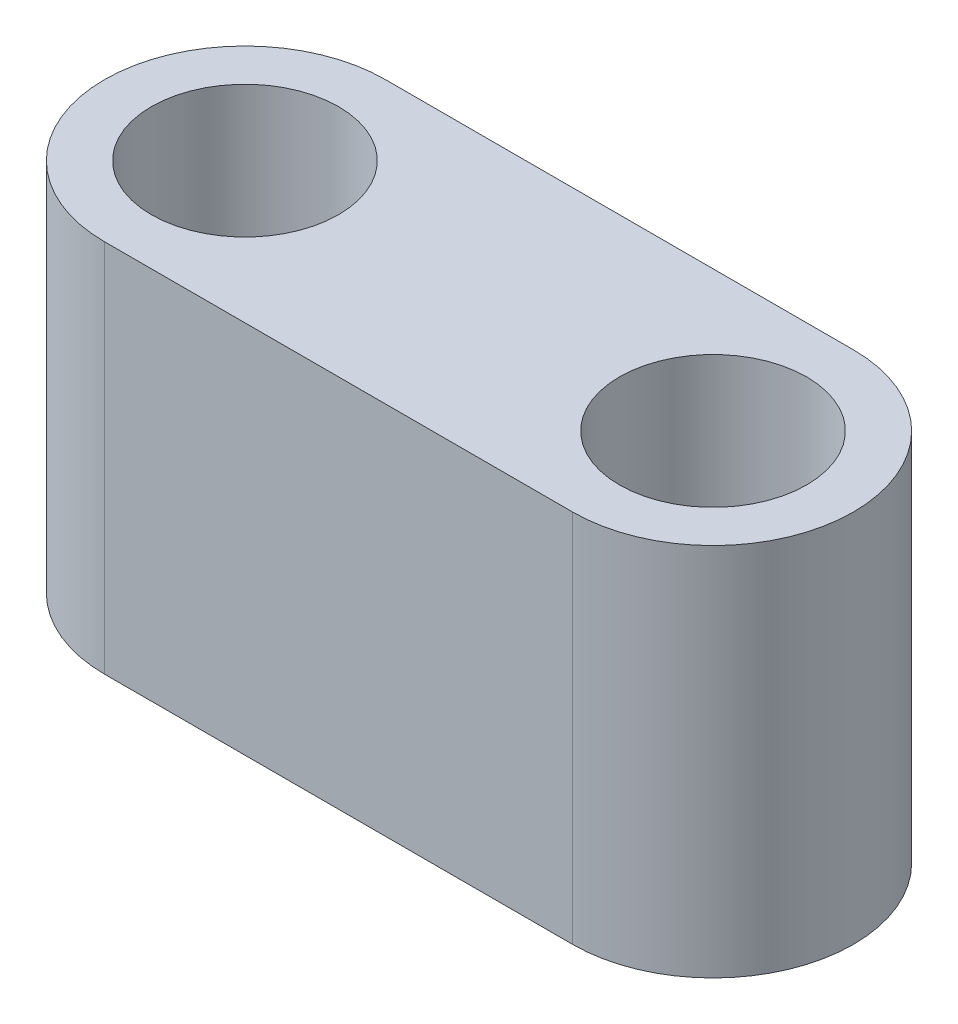
ISO-10303-21;
HEADER;
FILE_DESCRIPTION(('STEP AP214'),'2;1');
FILE_NAME('part.step','',(''),(''),'','','');
FILE_SCHEMA(('AUTOMOTIVE_DESIGN { 1 0 10303 214 1 1 1 1 }'));
ENDSEC;
DATA;
#1=APPLICATION_CONTEXT('core data for automotive mechanical design processes');
#2=APPLICATION_PROTOCOL_DEFINITION('international standard','automotive_design',2000,#1);
#3=PRODUCT_CONTEXT('',#1,'mechanical');
#4=PRODUCT('Part','Part','',(#3));
#5=PRODUCT_RELATED_PRODUCT_CATEGORY('part','',(#4));
#6=PRODUCT_DEFINITION_FORMATION('','',#4);
#7=PRODUCT_DEFINITION_CONTEXT('part definition',#1,'design');
#8=PRODUCT_DEFINITION('design','',#6,#7);
#9=PRODUCT_DEFINITION_SHAPE('','',#8);
#10=(LENGTH_UNIT() NAMED_UNIT(*) SI_UNIT(.MILLI.,.METRE.));
#11=(NAMED_UNIT(*) PLANE_ANGLE_UNIT() SI_UNIT($,.RADIAN.));
#12=(NAMED_UNIT(*) SI_UNIT($,.STERADIAN.) SOLID_ANGLE_UNIT());
#13=UNCERTAINTY_MEASURE_WITH_UNIT(LENGTH_MEASURE(1.E-05),#10,'distance_accuracy_value','');
#14=(GEOMETRIC_REPRESENTATION_CONTEXT(3) GLOBAL_UNCERTAINTY_ASSIGNED_CONTEXT((#13)) GLOBAL_UNIT_ASSIGNED_CONTEXT((#10,
#11,#12)) REPRESENTATION_CONTEXT('',''));
#15=CARTESIAN_POINT('',(0.,0.,0.));
#16=DIRECTION('',(0.,0.,1.));
#17=DIRECTION('',(1.,0.,0.));
#18=AXIS2_PLACEMENT_3D('',#15,#16,#17);
#19=CARTESIAN_POINT('',(0.,4.,0.));
#20=DIRECTION('',(0.,1.,0.));
#21=DIRECTION('',(0.,0.,1.));
#22=AXIS2_PLACEMENT_3D('',#19,#20,#21);
#23=PLANE('',#22);
#24=CARTESIAN_POINT('',(0.,4.,0.));
#25=DIRECTION('',(0.,1.,0.));
#26=DIRECTION('',(0.,0.,1.));
#27=AXIS2_PLACEMENT_3D('',#24,#25,#26);
#28=CIRCLE('',#27,1.);
#29=CARTESIAN_POINT('',(0.,4.,1.));
#30=VERTEX_POINT('',#29);
#31=EDGE_CURVE('E116',#30,#30,#28,.T.);
#32=ORIENTED_EDGE('',*,*,#31,.F.);
#33=EDGE_LOOP('',(#32));
#34=FACE_BOUND('',#33,.T.);
#35=CARTESIAN_POINT('',(0.,4.,0.));
#36=DIRECTION('',(0.,1.,0.));
#37=DIRECTION('',(0.,0.,1.));
#38=AXIS2_PLACEMENT_3D('',#35,#36,#37);
#39=CIRCLE('',#38,1.5);
#40=CARTESIAN_POINT('',(0.,4.,-1.5));
#41=VERTEX_POINT('',#40);
#42=CARTESIAN_POINT('',(0.,4.,1.5));
#43=VERTEX_POINT('',#42);
#44=EDGE_CURVE('E96',#41,#43,#39,.T.);
#45=ORIENTED_EDGE('',*,*,#44,.T.);
#46=DIRECTION('',(1.,0.,0.));
#47=VECTOR('',#46,1.);
#48=CARTESIAN_POINT('',(0.,4.,1.5));
#49=LINE('',#48,#47);
#50=CARTESIAN_POINT('',(5.,4.,1.5));
#51=VERTEX_POINT('',#50);
#52=EDGE_CURVE('E91',#43,#51,#49,.T.);
#53=ORIENTED_EDGE('',*,*,#52,.T.);
#54=CARTESIAN_POINT('',(5.,4.,0.));
#55=DIRECTION('',(0.,1.,0.));
#56=DIRECTION('',(0.,0.,1.));
#57=AXIS2_PLACEMENT_3D('',#54,#55,#56);
#58=CIRCLE('',#57,1.5);
#59=CARTESIAN_POINT('',(5.,4.,-1.5));
#60=VERTEX_POINT('',#59);
#61=EDGE_CURVE('E94',#51,#60,#58,.T.);
#62=ORIENTED_EDGE('',*,*,#61,.T.);
#63=DIRECTION('',(-1.,0.,0.));
#64=VECTOR('',#63,1.);
#65=CARTESIAN_POINT('',(0.,4.,-1.5));
#66=LINE('',#65,#64);
#67=EDGE_CURVE('E61',#60,#41,#66,.T.);
#68=ORIENTED_EDGE('',*,*,#67,.T.);
#69=EDGE_LOOP('',(#45,#53,#62,#68));
#70=FACE_BOUND('',#69,.T.);
#71=CARTESIAN_POINT('',(5.,4.,0.));
#72=DIRECTION('',(0.,1.,0.));
#73=DIRECTION('',(0.,0.,1.));
#74=AXIS2_PLACEMENT_3D('',#71,#72,#73);
#75=CIRCLE('',#74,1.);
#76=CARTESIAN_POINT('',(5.,4.,1.));
#77=VERTEX_POINT('',#76);
#78=EDGE_CURVE('E138',#77,#77,#75,.T.);
#79=ORIENTED_EDGE('',*,*,#78,.F.);
#80=EDGE_LOOP('',(#79));
#81=FACE_BOUND('',#80,.T.);
#82=ADVANCED_FACE('F43',(#34,#70,#81),#23,.T.);
#83=CARTESIAN_POINT('',(0.,0.,0.));
#84=DIRECTION('',(0.,1.,0.));
#85=DIRECTION('',(0.,0.,1.));
#86=AXIS2_PLACEMENT_3D('',#83,#84,#85);
#87=PLANE('',#86);
#88=CARTESIAN_POINT('',(0.,0.,0.));
#89=DIRECTION('',(0.,1.,0.));
#90=DIRECTION('',(0.,0.,1.));
#91=AXIS2_PLACEMENT_3D('',#88,#89,#90);
#92=CIRCLE('',#91,1.5);
#93=CARTESIAN_POINT('',(0.,0.,-1.5));
#94=VERTEX_POINT('',#93);
#95=CARTESIAN_POINT('',(0.,0.,1.5));
#96=VERTEX_POINT('',#95);
#97=EDGE_CURVE('E112',#94,#96,#92,.T.);
#98=ORIENTED_EDGE('',*,*,#97,.F.);
#99=DIRECTION('',(-1.,0.,0.));
#100=VECTOR('',#99,1.);
#101=CARTESIAN_POINT('',(0.,0.,-1.5));
#102=LINE('',#101,#100);
#103=CARTESIAN_POINT('',(5.,0.,-1.5));
#104=VERTEX_POINT('',#103);
#105=EDGE_CURVE('E84',#104,#94,#102,.T.);
#106=ORIENTED_EDGE('',*,*,#105,.F.);
#107=CARTESIAN_POINT('',(5.,0.,0.));
#108=DIRECTION('',(0.,1.,0.));
#109=DIRECTION('',(0.,0.,1.));
#110=AXIS2_PLACEMENT_3D('',#107,#108,#109);
#111=CIRCLE('',#110,1.5);
#112=CARTESIAN_POINT('',(5.,0.,1.5));
#113=VERTEX_POINT('',#112);
#114=EDGE_CURVE('E78',#113,#104,#111,.T.);
#115=ORIENTED_EDGE('',*,*,#114,.F.);
#116=DIRECTION('',(1.,0.,0.));
#117=VECTOR('',#116,1.);
#118=CARTESIAN_POINT('',(0.,0.,1.5));
#119=LINE('',#118,#117);
#120=EDGE_CURVE('E101',#96,#113,#119,.T.);
#121=ORIENTED_EDGE('',*,*,#120,.F.);
#122=EDGE_LOOP('',(#98,#106,#115,#121));
#123=FACE_BOUND('',#122,.T.);
#124=CARTESIAN_POINT('',(0.,0.,0.));
#125=DIRECTION('',(0.,1.,0.));
#126=DIRECTION('',(0.,0.,1.));
#127=AXIS2_PLACEMENT_3D('',#124,#125,#126);
#128=CIRCLE('',#127,1.);
#129=CARTESIAN_POINT('',(0.,0.,1.));
#130=VERTEX_POINT('',#129);
#131=EDGE_CURVE('E134',#130,#130,#128,.T.);
#132=ORIENTED_EDGE('',*,*,#131,.T.);
#133=EDGE_LOOP('',(#132));
#134=FACE_BOUND('',#133,.T.);
#135=CARTESIAN_POINT('',(5.,0.,0.));
#136=DIRECTION('',(0.,1.,0.));
#137=DIRECTION('',(0.,0.,1.));
#138=AXIS2_PLACEMENT_3D('',#135,#136,#137);
#139=CIRCLE('',#138,1.);
#140=CARTESIAN_POINT('',(5.,0.,1.));
#141=VERTEX_POINT('',#140);
#142=EDGE_CURVE('E142',#141,#141,#139,.T.);
#143=ORIENTED_EDGE('',*,*,#142,.T.);
#144=EDGE_LOOP('',(#143));
#145=FACE_BOUND('',#144,.T.);
#146=ADVANCED_FACE('F129',(#123,#134,#145),#87,.F.);
#147=CARTESIAN_POINT('',(0.,4.,0.));
#148=DIRECTION('',(0.,-1.,0.));
#149=DIRECTION('',(0.,0.,-1.));
#150=AXIS2_PLACEMENT_3D('',#147,#148,#149);
#151=CYLINDRICAL_SURFACE('',#150,1.5);
#152=ORIENTED_EDGE('',*,*,#97,.T.);
#153=DIRECTION('',(0.,-1.,0.));
#154=VECTOR('',#153,1.);
#155=CARTESIAN_POINT('',(0.,4.,1.5));
#156=LINE('',#155,#154);
#157=EDGE_CURVE('E11',#43,#96,#156,.T.);
#158=ORIENTED_EDGE('',*,*,#157,.F.);
#159=ORIENTED_EDGE('',*,*,#44,.F.);
#160=DIRECTION('',(0.,-1.,0.));
#161=VECTOR('',#160,1.);
#162=CARTESIAN_POINT('',(0.,4.,-1.5));
#163=LINE('',#162,#161);
#164=EDGE_CURVE('E108',#41,#94,#163,.T.);
#165=ORIENTED_EDGE('',*,*,#164,.T.);
#166=EDGE_LOOP('',(#152,#158,#159,#165));
#167=FACE_BOUND('',#166,.T.);
#168=ADVANCED_FACE('F45',(#167),#151,.T.);
#169=CARTESIAN_POINT('',(0.,4.,1.5));
#170=DIRECTION('',(0.,0.,-1.));
#171=DIRECTION('',(-1.,0.,0.));
#172=AXIS2_PLACEMENT_3D('',#169,#170,#171);
#173=PLANE('',#172);
#174=ORIENTED_EDGE('',*,*,#120,.T.);
#175=DIRECTION('',(0.,-1.,0.));
#176=VECTOR('',#175,1.);
#177=CARTESIAN_POINT('',(5.,4.,1.5));
#178=LINE('',#177,#176);
#179=EDGE_CURVE('E53',#51,#113,#178,.T.);
#180=ORIENTED_EDGE('',*,*,#179,.F.);
#181=ORIENTED_EDGE('',*,*,#52,.F.);
#182=ORIENTED_EDGE('',*,*,#157,.T.);
#183=EDGE_LOOP('',(#174,#180,#181,#182));
#184=FACE_BOUND('',#183,.T.);
#185=ADVANCED_FACE('F100',(#184),#173,.F.);
#186=CARTESIAN_POINT('',(5.,4.,0.));
#187=DIRECTION('',(0.,-1.,0.));
#188=DIRECTION('',(0.,0.,-1.));
#189=AXIS2_PLACEMENT_3D('',#186,#187,#188);
#190=CYLINDRICAL_SURFACE('',#189,1.5);
#191=ORIENTED_EDGE('',*,*,#114,.T.);
#192=DIRECTION('',(0.,-1.,0.));
#193=VECTOR('',#192,1.);
#194=CARTESIAN_POINT('',(5.,4.,-1.5));
#195=LINE('',#194,#193);
#196=EDGE_CURVE('E103',#60,#104,#195,.T.);
#197=ORIENTED_EDGE('',*,*,#196,.F.);
#198=ORIENTED_EDGE('',*,*,#61,.F.);
#199=ORIENTED_EDGE('',*,*,#179,.T.);
#200=EDGE_LOOP('',(#191,#197,#198,#199));
#201=FACE_BOUND('',#200,.T.);
#202=ADVANCED_FACE('F104',(#201),#190,.T.);
#203=CARTESIAN_POINT('',(0.,4.,-1.5));
#204=DIRECTION('',(0.,0.,1.));
#205=DIRECTION('',(1.,0.,0.));
#206=AXIS2_PLACEMENT_3D('',#203,#204,#205);
#207=PLANE('',#206);
#208=ORIENTED_EDGE('',*,*,#105,.T.);
#209=ORIENTED_EDGE('',*,*,#164,.F.);
#210=ORIENTED_EDGE('',*,*,#67,.F.);
#211=ORIENTED_EDGE('',*,*,#196,.T.);
#212=EDGE_LOOP('',(#208,#209,#210,#211));
#213=FACE_BOUND('',#212,.T.);
#214=ADVANCED_FACE('F126',(#213),#207,.F.);
#215=CARTESIAN_POINT('',(0.,4.,0.));
#216=DIRECTION('',(0.,-1.,0.));
#217=DIRECTION('',(0.,0.,-1.));
#218=AXIS2_PLACEMENT_3D('',#215,#216,#217);
#219=CYLINDRICAL_SURFACE('',#218,1.);
#220=ORIENTED_EDGE('',*,*,#31,.T.);
#221=EDGE_LOOP('',(#220));
#222=FACE_BOUND('',#221,.T.);
#223=ORIENTED_EDGE('',*,*,#131,.F.);
#224=EDGE_LOOP('',(#223));
#225=FACE_BOUND('',#224,.T.);
#226=ADVANCED_FACE('F161',(#222,#225),#219,.F.);
#227=CARTESIAN_POINT('',(5.,4.,0.));
#228=DIRECTION('',(0.,-1.,0.));
#229=DIRECTION('',(0.,0.,-1.));
#230=AXIS2_PLACEMENT_3D('',#227,#228,#229);
#231=CYLINDRICAL_SURFACE('',#230,1.);
#232=ORIENTED_EDGE('',*,*,#78,.T.);
#233=EDGE_LOOP('',(#232));
#234=FACE_BOUND('',#233,.T.);
#235=ORIENTED_EDGE('',*,*,#142,.F.);
#236=EDGE_LOOP('',(#235));
#237=FACE_BOUND('',#236,.T.);
#238=ADVANCED_FACE('F150',(#234,#237),#231,.F.);
#239=CLOSED_SHELL('',(#82,#146,#168,#185,#202,#214,#226,#238));
#240=MANIFOLD_SOLID_BREP('B2',#239);
#241=ADVANCED_BREP_SHAPE_REPRESENTATION('',(#18,#240),#14);
#242=SHAPE_DEFINITION_REPRESENTATION(#9,#241);
ENDSEC;
END-ISO-10303-21;
